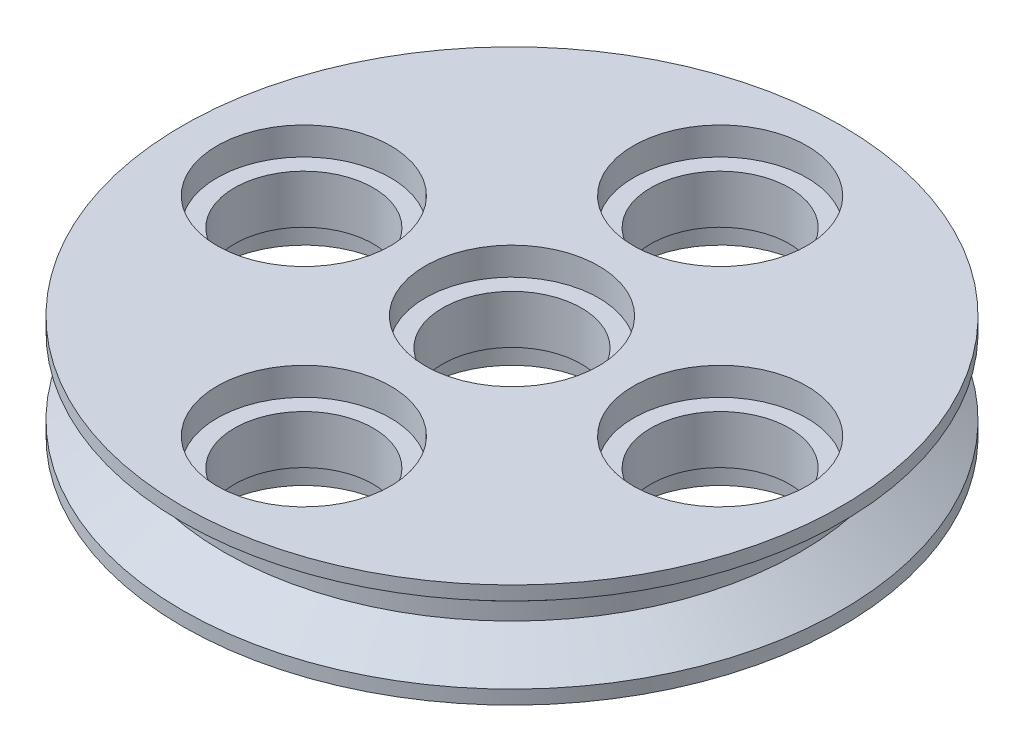
ISO-10303-21;
HEADER;
FILE_DESCRIPTION(('STEP AP214'),'2;1');
FILE_NAME('part.step','',(''),(''),'','','');
FILE_SCHEMA(('AUTOMOTIVE_DESIGN { 1 0 10303 214 1 1 1 1 }'));
ENDSEC;
DATA;
#1=APPLICATION_CONTEXT('core data for automotive mechanical design processes');
#2=APPLICATION_PROTOCOL_DEFINITION('international standard','automotive_design',2000,#1);
#3=PRODUCT_CONTEXT('',#1,'mechanical');
#4=PRODUCT('Part','Part','',(#3));
#5=PRODUCT_RELATED_PRODUCT_CATEGORY('part','',(#4));
#6=PRODUCT_DEFINITION_FORMATION('','',#4);
#7=PRODUCT_DEFINITION_CONTEXT('part definition',#1,'design');
#8=PRODUCT_DEFINITION('design','',#6,#7);
#9=PRODUCT_DEFINITION_SHAPE('','',#8);
#10=(LENGTH_UNIT() NAMED_UNIT(*) SI_UNIT(.MILLI.,.METRE.));
#11=(NAMED_UNIT(*) PLANE_ANGLE_UNIT() SI_UNIT($,.RADIAN.));
#12=(NAMED_UNIT(*) SI_UNIT($,.STERADIAN.) SOLID_ANGLE_UNIT());
#13=UNCERTAINTY_MEASURE_WITH_UNIT(LENGTH_MEASURE(1.E-05),#10,'distance_accuracy_value','');
#14=(GEOMETRIC_REPRESENTATION_CONTEXT(3) GLOBAL_UNCERTAINTY_ASSIGNED_CONTEXT((#13)) GLOBAL_UNIT_ASSIGNED_CONTEXT((#10,
#11,#12)) REPRESENTATION_CONTEXT('',''));
#15=CARTESIAN_POINT('',(0.,0.,0.));
#16=DIRECTION('',(0.,0.,1.));
#17=DIRECTION('',(1.,0.,0.));
#18=AXIS2_PLACEMENT_3D('',#15,#16,#17);
#19=CARTESIAN_POINT('',(0.,1.5,0.));
#20=DIRECTION('',(0.,-1.,0.));
#21=DIRECTION('',(0.,0.,-1.));
#22=AXIS2_PLACEMENT_3D('',#19,#20,#21);
#23=PLANE('',#22);
#24=CARTESIAN_POINT('',(0.,1.5,0.));
#25=DIRECTION('',(0.,-1.,0.));
#26=DIRECTION('',(0.,0.,-1.));
#27=AXIS2_PLACEMENT_3D('',#24,#25,#26);
#28=CIRCLE('',#27,9.5);
#29=CARTESIAN_POINT('',(0.,1.5,-9.5));
#30=VERTEX_POINT('',#29);
#31=EDGE_CURVE('E106',#30,#30,#28,.T.);
#32=ORIENTED_EDGE('',*,*,#31,.F.);
#33=EDGE_LOOP('',(#32));
#34=FACE_BOUND('',#33,.T.);
#35=CARTESIAN_POINT('',(6.,1.5,0.));
#36=DIRECTION('',(0.,1.,0.));
#37=DIRECTION('',(0.,0.,1.));
#38=AXIS2_PLACEMENT_3D('',#35,#36,#37);
#39=CIRCLE('',#38,2.5);
#40=CARTESIAN_POINT('',(6.,1.5,2.5));
#41=VERTEX_POINT('',#40);
#42=EDGE_CURVE('E109',#41,#41,#39,.F.);
#43=ORIENTED_EDGE('',*,*,#42,.T.);
#44=EDGE_LOOP('',(#43));
#45=FACE_BOUND('',#44,.T.);
#46=CARTESIAN_POINT('',(0.,1.5,6.));
#47=DIRECTION('',(0.,1.,0.));
#48=DIRECTION('',(0.,0.,1.));
#49=AXIS2_PLACEMENT_3D('',#46,#47,#48);
#50=CIRCLE('',#49,2.5);
#51=CARTESIAN_POINT('',(0.,1.5,8.5));
#52=VERTEX_POINT('',#51);
#53=EDGE_CURVE('E112',#52,#52,#50,.F.);
#54=ORIENTED_EDGE('',*,*,#53,.T.);
#55=EDGE_LOOP('',(#54));
#56=FACE_BOUND('',#55,.T.);
#57=CARTESIAN_POINT('',(-6.,1.5,0.));
#58=DIRECTION('',(0.,1.,0.));
#59=DIRECTION('',(0.,0.,1.));
#60=AXIS2_PLACEMENT_3D('',#57,#58,#59);
#61=CIRCLE('',#60,2.5);
#62=CARTESIAN_POINT('',(-6.,1.5,2.5));
#63=VERTEX_POINT('',#62);
#64=EDGE_CURVE('E115',#63,#63,#61,.F.);
#65=ORIENTED_EDGE('',*,*,#64,.T.);
#66=EDGE_LOOP('',(#65));
#67=FACE_BOUND('',#66,.T.);
#68=CARTESIAN_POINT('',(0.,1.5,-6.));
#69=DIRECTION('',(0.,1.,0.));
#70=DIRECTION('',(0.,0.,1.));
#71=AXIS2_PLACEMENT_3D('',#68,#69,#70);
#72=CIRCLE('',#71,2.5);
#73=CARTESIAN_POINT('',(0.,1.5,-3.5));
#74=VERTEX_POINT('',#73);
#75=EDGE_CURVE('E117',#74,#74,#72,.F.);
#76=ORIENTED_EDGE('',*,*,#75,.T.);
#77=EDGE_LOOP('',(#76));
#78=FACE_BOUND('',#77,.T.);
#79=CARTESIAN_POINT('',(0.,1.5,0.));
#80=DIRECTION('',(0.,1.,0.));
#81=DIRECTION('',(0.,0.,1.));
#82=AXIS2_PLACEMENT_3D('',#79,#80,#81);
#83=CIRCLE('',#82,2.5);
#84=CARTESIAN_POINT('',(0.,1.5,2.5));
#85=VERTEX_POINT('',#84);
#86=EDGE_CURVE('E17',#85,#85,#83,.F.);
#87=ORIENTED_EDGE('',*,*,#86,.T.);
#88=EDGE_LOOP('',(#87));
#89=FACE_BOUND('',#88,.T.);
#90=ADVANCED_FACE('F14',(#34,#45,#56,#67,#78,#89),#23,.F.);
#91=CARTESIAN_POINT('',(0.,1.5,0.));
#92=DIRECTION('',(0.,1.,0.));
#93=DIRECTION('',(0.,0.,1.));
#94=AXIS2_PLACEMENT_3D('',#91,#92,#93);
#95=CYLINDRICAL_SURFACE('',#94,2.5);
#96=CARTESIAN_POINT('',(0.,0.700000000000001,0.));
#97=DIRECTION('',(0.,1.,0.));
#98=DIRECTION('',(0.,0.,1.));
#99=AXIS2_PLACEMENT_3D('',#96,#97,#98);
#100=CIRCLE('',#99,2.5);
#101=CARTESIAN_POINT('',(0.,0.700000000000001,2.5));
#102=VERTEX_POINT('',#101);
#103=EDGE_CURVE('E103',#102,#102,#100,.F.);
#104=ORIENTED_EDGE('',*,*,#103,.T.);
#105=EDGE_LOOP('',(#104));
#106=FACE_BOUND('',#105,.T.);
#107=ORIENTED_EDGE('',*,*,#86,.F.);
#108=EDGE_LOOP('',(#107));
#109=FACE_BOUND('',#108,.T.);
#110=ADVANCED_FACE('F125',(#106,#109),#95,.F.);
#111=CARTESIAN_POINT('',(0.,1.5,-6.));
#112=DIRECTION('',(0.,1.,0.));
#113=DIRECTION('',(0.,0.,1.));
#114=AXIS2_PLACEMENT_3D('',#111,#112,#113);
#115=CYLINDRICAL_SURFACE('',#114,2.5);
#116=CARTESIAN_POINT('',(0.,0.700000000000001,-6.));
#117=DIRECTION('',(0.,1.,0.));
#118=DIRECTION('',(0.,0.,1.));
#119=AXIS2_PLACEMENT_3D('',#116,#117,#118);
#120=CIRCLE('',#119,2.5);
#121=CARTESIAN_POINT('',(0.,0.700000000000001,-3.5));
#122=VERTEX_POINT('',#121);
#123=EDGE_CURVE('E100',#122,#122,#120,.F.);
#124=ORIENTED_EDGE('',*,*,#123,.T.);
#125=EDGE_LOOP('',(#124));
#126=FACE_BOUND('',#125,.T.);
#127=ORIENTED_EDGE('',*,*,#75,.F.);
#128=EDGE_LOOP('',(#127));
#129=FACE_BOUND('',#128,.T.);
#130=ADVANCED_FACE('F127',(#126,#129),#115,.F.);
#131=CARTESIAN_POINT('',(-6.,1.5,0.));
#132=DIRECTION('',(0.,1.,0.));
#133=DIRECTION('',(0.,0.,1.));
#134=AXIS2_PLACEMENT_3D('',#131,#132,#133);
#135=CYLINDRICAL_SURFACE('',#134,2.5);
#136=CARTESIAN_POINT('',(-6.,0.700000000000001,0.));
#137=DIRECTION('',(0.,1.,0.));
#138=DIRECTION('',(0.,0.,1.));
#139=AXIS2_PLACEMENT_3D('',#136,#137,#138);
#140=CIRCLE('',#139,2.5);
#141=CARTESIAN_POINT('',(-6.,0.700000000000001,2.5));
#142=VERTEX_POINT('',#141);
#143=EDGE_CURVE('E97',#142,#142,#140,.F.);
#144=ORIENTED_EDGE('',*,*,#143,.T.);
#145=EDGE_LOOP('',(#144));
#146=FACE_BOUND('',#145,.T.);
#147=ORIENTED_EDGE('',*,*,#64,.F.);
#148=EDGE_LOOP('',(#147));
#149=FACE_BOUND('',#148,.T.);
#150=ADVANCED_FACE('F134',(#146,#149),#135,.F.);
#151=CARTESIAN_POINT('',(0.,1.5,6.));
#152=DIRECTION('',(0.,1.,0.));
#153=DIRECTION('',(0.,0.,1.));
#154=AXIS2_PLACEMENT_3D('',#151,#152,#153);
#155=CYLINDRICAL_SURFACE('',#154,2.5);
#156=CARTESIAN_POINT('',(0.,0.700000000000001,6.));
#157=DIRECTION('',(0.,1.,0.));
#158=DIRECTION('',(0.,0.,1.));
#159=AXIS2_PLACEMENT_3D('',#156,#157,#158);
#160=CIRCLE('',#159,2.5);
#161=CARTESIAN_POINT('',(0.,0.700000000000001,8.5));
#162=VERTEX_POINT('',#161);
#163=EDGE_CURVE('E94',#162,#162,#160,.F.);
#164=ORIENTED_EDGE('',*,*,#163,.T.);
#165=EDGE_LOOP('',(#164));
#166=FACE_BOUND('',#165,.T.);
#167=ORIENTED_EDGE('',*,*,#53,.F.);
#168=EDGE_LOOP('',(#167));
#169=FACE_BOUND('',#168,.T.);
#170=ADVANCED_FACE('F248',(#166,#169),#155,.F.);
#171=CARTESIAN_POINT('',(6.,1.5,0.));
#172=DIRECTION('',(0.,1.,0.));
#173=DIRECTION('',(0.,0.,1.));
#174=AXIS2_PLACEMENT_3D('',#171,#172,#173);
#175=CYLINDRICAL_SURFACE('',#174,2.5);
#176=CARTESIAN_POINT('',(6.,0.700000000000001,0.));
#177=DIRECTION('',(0.,1.,0.));
#178=DIRECTION('',(0.,0.,1.));
#179=AXIS2_PLACEMENT_3D('',#176,#177,#178);
#180=CIRCLE('',#179,2.5);
#181=CARTESIAN_POINT('',(6.,0.700000000000001,2.5));
#182=VERTEX_POINT('',#181);
#183=EDGE_CURVE('E91',#182,#182,#180,.F.);
#184=ORIENTED_EDGE('',*,*,#183,.T.);
#185=EDGE_LOOP('',(#184));
#186=FACE_BOUND('',#185,.T.);
#187=ORIENTED_EDGE('',*,*,#42,.F.);
#188=EDGE_LOOP('',(#187));
#189=FACE_BOUND('',#188,.T.);
#190=ADVANCED_FACE('F244',(#186,#189),#175,.F.);
#191=CARTESIAN_POINT('',(0.,0.,0.));
#192=DIRECTION('',(0.,-1.,0.));
#193=DIRECTION('',(0.,0.,-1.));
#194=AXIS2_PLACEMENT_3D('',#191,#192,#193);
#195=CYLINDRICAL_SURFACE('',#194,9.5);
#196=CARTESIAN_POINT('',(0.,1.1,0.));
#197=DIRECTION('',(0.,1.,0.));
#198=DIRECTION('',(0.,0.,1.));
#199=AXIS2_PLACEMENT_3D('',#196,#197,#198);
#200=CIRCLE('',#199,9.5);
#201=CARTESIAN_POINT('',(0.,1.1,9.5));
#202=VERTEX_POINT('',#201);
#203=EDGE_CURVE('E29',#202,#202,#200,.F.);
#204=ORIENTED_EDGE('',*,*,#203,.F.);
#205=EDGE_LOOP('',(#204));
#206=FACE_BOUND('',#205,.T.);
#207=ORIENTED_EDGE('',*,*,#31,.T.);
#208=EDGE_LOOP('',(#207));
#209=FACE_BOUND('',#208,.T.);
#210=ADVANCED_FACE('F240',(#206,#209),#195,.T.);
#211=CARTESIAN_POINT('',(2.00000000000001,0.700000000000003,0.));
#212=DIRECTION('',(0.,-1.,0.));
#213=DIRECTION('',(0.,0.,-1.));
#214=AXIS2_PLACEMENT_3D('',#211,#212,#213);
#215=PLANE('',#214);
#216=ORIENTED_EDGE('',*,*,#103,.F.);
#217=EDGE_LOOP('',(#216));
#218=FACE_BOUND('',#217,.T.);
#219=CARTESIAN_POINT('',(0.,0.700000000000004,0.));
#220=DIRECTION('',(0.,1.,0.));
#221=DIRECTION('',(0.,0.,1.));
#222=AXIS2_PLACEMENT_3D('',#219,#220,#221);
#223=CIRCLE('',#222,2.00000000000001);
#224=CARTESIAN_POINT('',(0.,0.700000000000004,2.00000000000001));
#225=VERTEX_POINT('',#224);
#226=EDGE_CURVE('E88',#225,#225,#223,.F.);
#227=ORIENTED_EDGE('',*,*,#226,.T.);
#228=EDGE_LOOP('',(#227));
#229=FACE_BOUND('',#228,.T.);
#230=ADVANCED_FACE('F236',(#218,#229),#215,.F.);
#231=CARTESIAN_POINT('',(2.00000000000001,0.700000000000003,-6.));
#232=DIRECTION('',(0.,-1.,0.));
#233=DIRECTION('',(0.,0.,-1.));
#234=AXIS2_PLACEMENT_3D('',#231,#232,#233);
#235=PLANE('',#234);
#236=ORIENTED_EDGE('',*,*,#123,.F.);
#237=EDGE_LOOP('',(#236));
#238=FACE_BOUND('',#237,.T.);
#239=CARTESIAN_POINT('',(0.,0.700000000000004,-6.));
#240=DIRECTION('',(0.,1.,0.));
#241=DIRECTION('',(0.,0.,1.));
#242=AXIS2_PLACEMENT_3D('',#239,#240,#241);
#243=CIRCLE('',#242,2.00000000000001);
#244=CARTESIAN_POINT('',(0.,0.700000000000004,-3.99999999999999));
#245=VERTEX_POINT('',#244);
#246=EDGE_CURVE('E85',#245,#245,#243,.F.);
#247=ORIENTED_EDGE('',*,*,#246,.T.);
#248=EDGE_LOOP('',(#247));
#249=FACE_BOUND('',#248,.T.);
#250=ADVANCED_FACE('F232',(#238,#249),#235,.F.);
#251=CARTESIAN_POINT('',(-3.99999999999999,0.700000000000003,0.));
#252=DIRECTION('',(0.,-1.,0.));
#253=DIRECTION('',(0.,0.,-1.));
#254=AXIS2_PLACEMENT_3D('',#251,#252,#253);
#255=PLANE('',#254);
#256=ORIENTED_EDGE('',*,*,#143,.F.);
#257=EDGE_LOOP('',(#256));
#258=FACE_BOUND('',#257,.T.);
#259=CARTESIAN_POINT('',(-6.,0.700000000000004,0.));
#260=DIRECTION('',(0.,1.,0.));
#261=DIRECTION('',(0.,0.,1.));
#262=AXIS2_PLACEMENT_3D('',#259,#260,#261);
#263=CIRCLE('',#262,2.00000000000001);
#264=CARTESIAN_POINT('',(-6.,0.700000000000004,2.00000000000001));
#265=VERTEX_POINT('',#264);
#266=EDGE_CURVE('E82',#265,#265,#263,.F.);
#267=ORIENTED_EDGE('',*,*,#266,.T.);
#268=EDGE_LOOP('',(#267));
#269=FACE_BOUND('',#268,.T.);
#270=ADVANCED_FACE('F228',(#258,#269),#255,.F.);
#271=CARTESIAN_POINT('',(2.00000000000001,0.700000000000003,6.));
#272=DIRECTION('',(0.,-1.,0.));
#273=DIRECTION('',(0.,0.,-1.));
#274=AXIS2_PLACEMENT_3D('',#271,#272,#273);
#275=PLANE('',#274);
#276=ORIENTED_EDGE('',*,*,#163,.F.);
#277=EDGE_LOOP('',(#276));
#278=FACE_BOUND('',#277,.T.);
#279=CARTESIAN_POINT('',(0.,0.700000000000004,6.));
#280=DIRECTION('',(0.,1.,0.));
#281=DIRECTION('',(0.,0.,1.));
#282=AXIS2_PLACEMENT_3D('',#279,#280,#281);
#283=CIRCLE('',#282,2.00000000000001);
#284=CARTESIAN_POINT('',(0.,0.700000000000004,8.00000000000001));
#285=VERTEX_POINT('',#284);
#286=EDGE_CURVE('E79',#285,#285,#283,.F.);
#287=ORIENTED_EDGE('',*,*,#286,.T.);
#288=EDGE_LOOP('',(#287));
#289=FACE_BOUND('',#288,.T.);
#290=ADVANCED_FACE('F224',(#278,#289),#275,.F.);
#291=CARTESIAN_POINT('',(8.00000000000001,0.700000000000003,0.));
#292=DIRECTION('',(0.,-1.,0.));
#293=DIRECTION('',(0.,0.,-1.));
#294=AXIS2_PLACEMENT_3D('',#291,#292,#293);
#295=PLANE('',#294);
#296=ORIENTED_EDGE('',*,*,#183,.F.);
#297=EDGE_LOOP('',(#296));
#298=FACE_BOUND('',#297,.T.);
#299=CARTESIAN_POINT('',(6.,0.700000000000004,0.));
#300=DIRECTION('',(0.,1.,0.));
#301=DIRECTION('',(0.,0.,1.));
#302=AXIS2_PLACEMENT_3D('',#299,#300,#301);
#303=CIRCLE('',#302,2.00000000000001);
#304=CARTESIAN_POINT('',(6.,0.700000000000004,2.00000000000001));
#305=VERTEX_POINT('',#304);
#306=EDGE_CURVE('E76',#305,#305,#303,.F.);
#307=ORIENTED_EDGE('',*,*,#306,.T.);
#308=EDGE_LOOP('',(#307));
#309=FACE_BOUND('',#308,.T.);
#310=ADVANCED_FACE('F220',(#298,#309),#295,.F.);
#311=CARTESIAN_POINT('',(0.,1.1,0.));
#312=DIRECTION('',(0.,1.,0.));
#313=DIRECTION('',(0.,0.,1.));
#314=AXIS2_PLACEMENT_3D('',#311,#312,#313);
#315=CONICAL_SURFACE('',#314,9.5,0.95423717715527);
#316=ORIENTED_EDGE('',*,*,#203,.T.);
#317=EDGE_LOOP('',(#316));
#318=FACE_BOUND('',#317,.T.);
#319=CARTESIAN_POINT('',(0.,0.25,0.));
#320=DIRECTION('',(0.,-1.,0.));
#321=DIRECTION('',(0.,0.,-1.));
#322=AXIS2_PLACEMENT_3D('',#319,#320,#321);
#323=CIRCLE('',#322,8.3006668519548);
#324=CARTESIAN_POINT('',(0.,0.25,-8.3006668519548));
#325=VERTEX_POINT('',#324);
#326=EDGE_CURVE('E75',#325,#325,#323,.T.);
#327=ORIENTED_EDGE('',*,*,#326,.F.);
#328=EDGE_LOOP('',(#327));
#329=FACE_BOUND('',#328,.T.);
#330=ADVANCED_FACE('F216',(#318,#329),#315,.T.);
#331=CARTESIAN_POINT('',(0.,1.5,0.));
#332=DIRECTION('',(0.,1.,0.));
#333=DIRECTION('',(0.,0.,1.));
#334=AXIS2_PLACEMENT_3D('',#331,#332,#333);
#335=CYLINDRICAL_SURFACE('',#334,2.00000000000001);
#336=CARTESIAN_POINT('',(0.,-0.700000000000004,0.));
#337=DIRECTION('',(0.,1.,0.));
#338=DIRECTION('',(0.,0.,1.));
#339=AXIS2_PLACEMENT_3D('',#336,#337,#338);
#340=CIRCLE('',#339,2.00000000000001);
#341=CARTESIAN_POINT('',(0.,-0.700000000000004,2.00000000000001));
#342=VERTEX_POINT('',#341);
#343=EDGE_CURVE('E72',#342,#342,#340,.F.);
#344=ORIENTED_EDGE('',*,*,#343,.T.);
#345=EDGE_LOOP('',(#344));
#346=FACE_BOUND('',#345,.T.);
#347=ORIENTED_EDGE('',*,*,#226,.F.);
#348=EDGE_LOOP('',(#347));
#349=FACE_BOUND('',#348,.T.);
#350=ADVANCED_FACE('F212',(#346,#349),#335,.F.);
#351=CARTESIAN_POINT('',(0.,1.5,-6.));
#352=DIRECTION('',(0.,1.,0.));
#353=DIRECTION('',(0.,0.,1.));
#354=AXIS2_PLACEMENT_3D('',#351,#352,#353);
#355=CYLINDRICAL_SURFACE('',#354,2.00000000000001);
#356=CARTESIAN_POINT('',(0.,-0.700000000000004,-6.));
#357=DIRECTION('',(0.,1.,0.));
#358=DIRECTION('',(0.,0.,1.));
#359=AXIS2_PLACEMENT_3D('',#356,#357,#358);
#360=CIRCLE('',#359,2.00000000000001);
#361=CARTESIAN_POINT('',(0.,-0.700000000000004,-3.99999999999999));
#362=VERTEX_POINT('',#361);
#363=EDGE_CURVE('E69',#362,#362,#360,.F.);
#364=ORIENTED_EDGE('',*,*,#363,.T.);
#365=EDGE_LOOP('',(#364));
#366=FACE_BOUND('',#365,.T.);
#367=ORIENTED_EDGE('',*,*,#246,.F.);
#368=EDGE_LOOP('',(#367));
#369=FACE_BOUND('',#368,.T.);
#370=ADVANCED_FACE('F208',(#366,#369),#355,.F.);
#371=CARTESIAN_POINT('',(-6.,1.5,0.));
#372=DIRECTION('',(0.,1.,0.));
#373=DIRECTION('',(0.,0.,1.));
#374=AXIS2_PLACEMENT_3D('',#371,#372,#373);
#375=CYLINDRICAL_SURFACE('',#374,2.00000000000001);
#376=CARTESIAN_POINT('',(-6.,-0.700000000000004,0.));
#377=DIRECTION('',(0.,1.,0.));
#378=DIRECTION('',(0.,0.,1.));
#379=AXIS2_PLACEMENT_3D('',#376,#377,#378);
#380=CIRCLE('',#379,2.00000000000001);
#381=CARTESIAN_POINT('',(-6.,-0.700000000000004,2.00000000000001));
#382=VERTEX_POINT('',#381);
#383=EDGE_CURVE('E66',#382,#382,#380,.F.);
#384=ORIENTED_EDGE('',*,*,#383,.T.);
#385=EDGE_LOOP('',(#384));
#386=FACE_BOUND('',#385,.T.);
#387=ORIENTED_EDGE('',*,*,#266,.F.);
#388=EDGE_LOOP('',(#387));
#389=FACE_BOUND('',#388,.T.);
#390=ADVANCED_FACE('F204',(#386,#389),#375,.F.);
#391=CARTESIAN_POINT('',(0.,1.5,6.));
#392=DIRECTION('',(0.,1.,0.));
#393=DIRECTION('',(0.,0.,1.));
#394=AXIS2_PLACEMENT_3D('',#391,#392,#393);
#395=CYLINDRICAL_SURFACE('',#394,2.00000000000001);
#396=CARTESIAN_POINT('',(0.,-0.700000000000004,6.));
#397=DIRECTION('',(0.,1.,0.));
#398=DIRECTION('',(0.,0.,1.));
#399=AXIS2_PLACEMENT_3D('',#396,#397,#398);
#400=CIRCLE('',#399,2.00000000000001);
#401=CARTESIAN_POINT('',(0.,-0.700000000000004,8.00000000000001));
#402=VERTEX_POINT('',#401);
#403=EDGE_CURVE('E63',#402,#402,#400,.F.);
#404=ORIENTED_EDGE('',*,*,#403,.T.);
#405=EDGE_LOOP('',(#404));
#406=FACE_BOUND('',#405,.T.);
#407=ORIENTED_EDGE('',*,*,#286,.F.);
#408=EDGE_LOOP('',(#407));
#409=FACE_BOUND('',#408,.T.);
#410=ADVANCED_FACE('F200',(#406,#409),#395,.F.);
#411=CARTESIAN_POINT('',(6.,1.5,0.));
#412=DIRECTION('',(0.,1.,0.));
#413=DIRECTION('',(0.,0.,1.));
#414=AXIS2_PLACEMENT_3D('',#411,#412,#413);
#415=CYLINDRICAL_SURFACE('',#414,2.00000000000001);
#416=CARTESIAN_POINT('',(6.,-0.700000000000004,0.));
#417=DIRECTION('',(0.,1.,0.));
#418=DIRECTION('',(0.,0.,1.));
#419=AXIS2_PLACEMENT_3D('',#416,#417,#418);
#420=CIRCLE('',#419,2.00000000000001);
#421=CARTESIAN_POINT('',(6.,-0.700000000000004,2.00000000000001));
#422=VERTEX_POINT('',#421);
#423=EDGE_CURVE('E60',#422,#422,#420,.F.);
#424=ORIENTED_EDGE('',*,*,#423,.T.);
#425=EDGE_LOOP('',(#424));
#426=FACE_BOUND('',#425,.T.);
#427=ORIENTED_EDGE('',*,*,#306,.F.);
#428=EDGE_LOOP('',(#427));
#429=FACE_BOUND('',#428,.T.);
#430=ADVANCED_FACE('F196',(#426,#429),#415,.F.);
#431=CARTESIAN_POINT('',(0.,0.,0.));
#432=DIRECTION('',(0.,-1.,0.));
#433=DIRECTION('',(0.,0.,-1.));
#434=AXIS2_PLACEMENT_3D('',#431,#432,#433);
#435=CYLINDRICAL_SURFACE('',#434,8.3006668519548);
#436=CARTESIAN_POINT('',(0.,-0.25,0.));
#437=DIRECTION('',(0.,-1.,0.));
#438=DIRECTION('',(0.,0.,1.));
#439=AXIS2_PLACEMENT_3D('',#436,#437,#438);
#440=CIRCLE('',#439,8.3006668519548);
#441=CARTESIAN_POINT('',(0.,-0.25,8.3006668519548));
#442=VERTEX_POINT('',#441);
#443=EDGE_CURVE('E59',#442,#442,#440,.T.);
#444=ORIENTED_EDGE('',*,*,#443,.F.);
#445=EDGE_LOOP('',(#444));
#446=FACE_BOUND('',#445,.T.);
#447=ORIENTED_EDGE('',*,*,#326,.T.);
#448=EDGE_LOOP('',(#447));
#449=FACE_BOUND('',#448,.T.);
#450=ADVANCED_FACE('F192',(#446,#449),#435,.T.);
#451=CARTESIAN_POINT('',(2.00000000000001,-0.700000000000003,0.));
#452=DIRECTION('',(0.,1.,0.));
#453=DIRECTION('',(0.,0.,1.));
#454=AXIS2_PLACEMENT_3D('',#451,#452,#453);
#455=PLANE('',#454);
#456=CARTESIAN_POINT('',(0.,-0.700000000000001,0.));
#457=DIRECTION('',(0.,-1.,0.));
#458=DIRECTION('',(0.,0.,-1.));
#459=AXIS2_PLACEMENT_3D('',#456,#457,#458);
#460=CIRCLE('',#459,2.5);
#461=CARTESIAN_POINT('',(0.,-0.700000000000001,-2.5));
#462=VERTEX_POINT('',#461);
#463=EDGE_CURVE('E56',#462,#462,#460,.T.);
#464=ORIENTED_EDGE('',*,*,#463,.T.);
#465=EDGE_LOOP('',(#464));
#466=FACE_BOUND('',#465,.T.);
#467=ORIENTED_EDGE('',*,*,#343,.F.);
#468=EDGE_LOOP('',(#467));
#469=FACE_BOUND('',#468,.T.);
#470=ADVANCED_FACE('F188',(#466,#469),#455,.F.);
#471=CARTESIAN_POINT('',(2.00000000000001,-0.700000000000003,-6.));
#472=DIRECTION('',(0.,1.,0.));
#473=DIRECTION('',(0.,0.,1.));
#474=AXIS2_PLACEMENT_3D('',#471,#472,#473);
#475=PLANE('',#474);
#476=CARTESIAN_POINT('',(0.,-0.700000000000001,-6.));
#477=DIRECTION('',(0.,-1.,0.));
#478=DIRECTION('',(0.,0.,-1.));
#479=AXIS2_PLACEMENT_3D('',#476,#477,#478);
#480=CIRCLE('',#479,2.5);
#481=CARTESIAN_POINT('',(0.,-0.700000000000001,-8.5));
#482=VERTEX_POINT('',#481);
#483=EDGE_CURVE('E53',#482,#482,#480,.T.);
#484=ORIENTED_EDGE('',*,*,#483,.T.);
#485=EDGE_LOOP('',(#484));
#486=FACE_BOUND('',#485,.T.);
#487=ORIENTED_EDGE('',*,*,#363,.F.);
#488=EDGE_LOOP('',(#487));
#489=FACE_BOUND('',#488,.T.);
#490=ADVANCED_FACE('F184',(#486,#489),#475,.F.);
#491=CARTESIAN_POINT('',(-3.99999999999999,-0.700000000000003,0.));
#492=DIRECTION('',(0.,1.,0.));
#493=DIRECTION('',(0.,0.,1.));
#494=AXIS2_PLACEMENT_3D('',#491,#492,#493);
#495=PLANE('',#494);
#496=CARTESIAN_POINT('',(-6.,-0.700000000000001,0.));
#497=DIRECTION('',(0.,-1.,0.));
#498=DIRECTION('',(0.,0.,-1.));
#499=AXIS2_PLACEMENT_3D('',#496,#497,#498);
#500=CIRCLE('',#499,2.5);
#501=CARTESIAN_POINT('',(-6.,-0.700000000000001,-2.5));
#502=VERTEX_POINT('',#501);
#503=EDGE_CURVE('E50',#502,#502,#500,.T.);
#504=ORIENTED_EDGE('',*,*,#503,.T.);
#505=EDGE_LOOP('',(#504));
#506=FACE_BOUND('',#505,.T.);
#507=ORIENTED_EDGE('',*,*,#383,.F.);
#508=EDGE_LOOP('',(#507));
#509=FACE_BOUND('',#508,.T.);
#510=ADVANCED_FACE('F180',(#506,#509),#495,.F.);
#511=CARTESIAN_POINT('',(2.00000000000001,-0.700000000000003,6.));
#512=DIRECTION('',(0.,1.,0.));
#513=DIRECTION('',(0.,0.,1.));
#514=AXIS2_PLACEMENT_3D('',#511,#512,#513);
#515=PLANE('',#514);
#516=CARTESIAN_POINT('',(0.,-0.700000000000001,6.));
#517=DIRECTION('',(0.,-1.,0.));
#518=DIRECTION('',(0.,0.,-1.));
#519=AXIS2_PLACEMENT_3D('',#516,#517,#518);
#520=CIRCLE('',#519,2.5);
#521=CARTESIAN_POINT('',(0.,-0.700000000000001,3.5));
#522=VERTEX_POINT('',#521);
#523=EDGE_CURVE('E47',#522,#522,#520,.T.);
#524=ORIENTED_EDGE('',*,*,#523,.T.);
#525=EDGE_LOOP('',(#524));
#526=FACE_BOUND('',#525,.T.);
#527=ORIENTED_EDGE('',*,*,#403,.F.);
#528=EDGE_LOOP('',(#527));
#529=FACE_BOUND('',#528,.T.);
#530=ADVANCED_FACE('F176',(#526,#529),#515,.F.);
#531=CARTESIAN_POINT('',(8.00000000000001,-0.700000000000003,0.));
#532=DIRECTION('',(0.,1.,0.));
#533=DIRECTION('',(0.,0.,1.));
#534=AXIS2_PLACEMENT_3D('',#531,#532,#533);
#535=PLANE('',#534);
#536=CARTESIAN_POINT('',(6.,-0.700000000000001,0.));
#537=DIRECTION('',(0.,-1.,0.));
#538=DIRECTION('',(0.,0.,-1.));
#539=AXIS2_PLACEMENT_3D('',#536,#537,#538);
#540=CIRCLE('',#539,2.5);
#541=CARTESIAN_POINT('',(6.,-0.700000000000001,-2.5));
#542=VERTEX_POINT('',#541);
#543=EDGE_CURVE('E44',#542,#542,#540,.T.);
#544=ORIENTED_EDGE('',*,*,#543,.T.);
#545=EDGE_LOOP('',(#544));
#546=FACE_BOUND('',#545,.T.);
#547=ORIENTED_EDGE('',*,*,#423,.F.);
#548=EDGE_LOOP('',(#547));
#549=FACE_BOUND('',#548,.T.);
#550=ADVANCED_FACE('F172',(#546,#549),#535,.F.);
#551=CARTESIAN_POINT('',(0.,-1.1,0.));
#552=DIRECTION('',(0.,-1.,0.));
#553=DIRECTION('',(0.,0.,-1.));
#554=AXIS2_PLACEMENT_3D('',#551,#552,#553);
#555=CONICAL_SURFACE('',#554,9.5,0.95423717715527);
#556=ORIENTED_EDGE('',*,*,#443,.T.);
#557=EDGE_LOOP('',(#556));
#558=FACE_BOUND('',#557,.T.);
#559=CARTESIAN_POINT('',(0.,-1.1,0.));
#560=DIRECTION('',(0.,1.,0.));
#561=DIRECTION('',(0.,0.,1.));
#562=AXIS2_PLACEMENT_3D('',#559,#560,#561);
#563=CIRCLE('',#562,9.5);
#564=CARTESIAN_POINT('',(0.,-1.1,9.5));
#565=VERTEX_POINT('',#564);
#566=EDGE_CURVE('E43',#565,#565,#563,.F.);
#567=ORIENTED_EDGE('',*,*,#566,.F.);
#568=EDGE_LOOP('',(#567));
#569=FACE_BOUND('',#568,.T.);
#570=ADVANCED_FACE('F168',(#558,#569),#555,.T.);
#571=CARTESIAN_POINT('',(0.,-1.5,0.));
#572=DIRECTION('',(0.,-1.,0.));
#573=DIRECTION('',(0.,0.,-1.));
#574=AXIS2_PLACEMENT_3D('',#571,#572,#573);
#575=CYLINDRICAL_SURFACE('',#574,2.5);
#576=CARTESIAN_POINT('',(0.,-1.5,0.));
#577=DIRECTION('',(0.,-1.,0.));
#578=DIRECTION('',(0.,0.,-1.));
#579=AXIS2_PLACEMENT_3D('',#576,#577,#578);
#580=CIRCLE('',#579,2.5);
#581=CARTESIAN_POINT('',(0.,-1.5,-2.5));
#582=VERTEX_POINT('',#581);
#583=EDGE_CURVE('E40',#582,#582,#580,.T.);
#584=ORIENTED_EDGE('',*,*,#583,.T.);
#585=EDGE_LOOP('',(#584));
#586=FACE_BOUND('',#585,.T.);
#587=ORIENTED_EDGE('',*,*,#463,.F.);
#588=EDGE_LOOP('',(#587));
#589=FACE_BOUND('',#588,.T.);
#590=ADVANCED_FACE('F164',(#586,#589),#575,.F.);
#591=CARTESIAN_POINT('',(0.,-1.5,-6.));
#592=DIRECTION('',(0.,-1.,0.));
#593=DIRECTION('',(0.,0.,-1.));
#594=AXIS2_PLACEMENT_3D('',#591,#592,#593);
#595=CYLINDRICAL_SURFACE('',#594,2.5);
#596=CARTESIAN_POINT('',(0.,-1.5,-6.));
#597=DIRECTION('',(0.,-1.,0.));
#598=DIRECTION('',(0.,0.,-1.));
#599=AXIS2_PLACEMENT_3D('',#596,#597,#598);
#600=CIRCLE('',#599,2.5);
#601=CARTESIAN_POINT('',(0.,-1.5,-8.5));
#602=VERTEX_POINT('',#601);
#603=EDGE_CURVE('E37',#602,#602,#600,.T.);
#604=ORIENTED_EDGE('',*,*,#603,.T.);
#605=EDGE_LOOP('',(#604));
#606=FACE_BOUND('',#605,.T.);
#607=ORIENTED_EDGE('',*,*,#483,.F.);
#608=EDGE_LOOP('',(#607));
#609=FACE_BOUND('',#608,.T.);
#610=ADVANCED_FACE('F160',(#606,#609),#595,.F.);
#611=CARTESIAN_POINT('',(-6.,-1.5,0.));
#612=DIRECTION('',(0.,-1.,0.));
#613=DIRECTION('',(0.,0.,-1.));
#614=AXIS2_PLACEMENT_3D('',#611,#612,#613);
#615=CYLINDRICAL_SURFACE('',#614,2.5);
#616=CARTESIAN_POINT('',(-6.,-1.5,0.));
#617=DIRECTION('',(0.,-1.,0.));
#618=DIRECTION('',(0.,0.,-1.));
#619=AXIS2_PLACEMENT_3D('',#616,#617,#618);
#620=CIRCLE('',#619,2.5);
#621=CARTESIAN_POINT('',(-6.,-1.5,-2.5));
#622=VERTEX_POINT('',#621);
#623=EDGE_CURVE('E34',#622,#622,#620,.T.);
#624=ORIENTED_EDGE('',*,*,#623,.T.);
#625=EDGE_LOOP('',(#624));
#626=FACE_BOUND('',#625,.T.);
#627=ORIENTED_EDGE('',*,*,#503,.F.);
#628=EDGE_LOOP('',(#627));
#629=FACE_BOUND('',#628,.T.);
#630=ADVANCED_FACE('F156',(#626,#629),#615,.F.);
#631=CARTESIAN_POINT('',(0.,-1.5,6.));
#632=DIRECTION('',(0.,-1.,0.));
#633=DIRECTION('',(0.,0.,-1.));
#634=AXIS2_PLACEMENT_3D('',#631,#632,#633);
#635=CYLINDRICAL_SURFACE('',#634,2.5);
#636=CARTESIAN_POINT('',(0.,-1.5,6.));
#637=DIRECTION('',(0.,-1.,0.));
#638=DIRECTION('',(0.,0.,-1.));
#639=AXIS2_PLACEMENT_3D('',#636,#637,#638);
#640=CIRCLE('',#639,2.5);
#641=CARTESIAN_POINT('',(0.,-1.5,3.5));
#642=VERTEX_POINT('',#641);
#643=EDGE_CURVE('E26',#642,#642,#640,.T.);
#644=ORIENTED_EDGE('',*,*,#643,.T.);
#645=EDGE_LOOP('',(#644));
#646=FACE_BOUND('',#645,.T.);
#647=ORIENTED_EDGE('',*,*,#523,.F.);
#648=EDGE_LOOP('',(#647));
#649=FACE_BOUND('',#648,.T.);
#650=ADVANCED_FACE('F152',(#646,#649),#635,.F.);
#651=CARTESIAN_POINT('',(6.,-1.5,0.));
#652=DIRECTION('',(0.,-1.,0.));
#653=DIRECTION('',(0.,0.,-1.));
#654=AXIS2_PLACEMENT_3D('',#651,#652,#653);
#655=CYLINDRICAL_SURFACE('',#654,2.5);
#656=CARTESIAN_POINT('',(6.,-1.5,0.));
#657=DIRECTION('',(0.,-1.,0.));
#658=DIRECTION('',(0.,0.,-1.));
#659=AXIS2_PLACEMENT_3D('',#656,#657,#658);
#660=CIRCLE('',#659,2.5);
#661=CARTESIAN_POINT('',(6.,-1.5,-2.5));
#662=VERTEX_POINT('',#661);
#663=EDGE_CURVE('E21',#662,#662,#660,.T.);
#664=ORIENTED_EDGE('',*,*,#663,.T.);
#665=EDGE_LOOP('',(#664));
#666=FACE_BOUND('',#665,.T.);
#667=ORIENTED_EDGE('',*,*,#543,.F.);
#668=EDGE_LOOP('',(#667));
#669=FACE_BOUND('',#668,.T.);
#670=ADVANCED_FACE('F146',(#666,#669),#655,.F.);
#671=CARTESIAN_POINT('',(0.,0.,0.));
#672=DIRECTION('',(0.,1.,0.));
#673=DIRECTION('',(0.,0.,1.));
#674=AXIS2_PLACEMENT_3D('',#671,#672,#673);
#675=CYLINDRICAL_SURFACE('',#674,9.5);
#676=CARTESIAN_POINT('',(0.,-1.5,0.));
#677=DIRECTION('',(0.,1.,0.));
#678=DIRECTION('',(0.,0.,1.));
#679=AXIS2_PLACEMENT_3D('',#676,#677,#678);
#680=CIRCLE('',#679,9.5);
#681=CARTESIAN_POINT('',(0.,-1.5,9.5));
#682=VERTEX_POINT('',#681);
#683=EDGE_CURVE('E10',#682,#682,#680,.T.);
#684=ORIENTED_EDGE('',*,*,#683,.T.);
#685=EDGE_LOOP('',(#684));
#686=FACE_BOUND('',#685,.T.);
#687=ORIENTED_EDGE('',*,*,#566,.T.);
#688=EDGE_LOOP('',(#687));
#689=FACE_BOUND('',#688,.T.);
#690=ADVANCED_FACE('F140',(#686,#689),#675,.T.);
#691=CARTESIAN_POINT('',(0.,-1.5,0.));
#692=DIRECTION('',(0.,1.,0.));
#693=DIRECTION('',(0.,0.,1.));
#694=AXIS2_PLACEMENT_3D('',#691,#692,#693);
#695=PLANE('',#694);
#696=ORIENTED_EDGE('',*,*,#683,.F.);
#697=EDGE_LOOP('',(#696));
#698=FACE_BOUND('',#697,.T.);
#699=ORIENTED_EDGE('',*,*,#663,.F.);
#700=EDGE_LOOP('',(#699));
#701=FACE_BOUND('',#700,.T.);
#702=ORIENTED_EDGE('',*,*,#643,.F.);
#703=EDGE_LOOP('',(#702));
#704=FACE_BOUND('',#703,.T.);
#705=ORIENTED_EDGE('',*,*,#623,.F.);
#706=EDGE_LOOP('',(#705));
#707=FACE_BOUND('',#706,.T.);
#708=ORIENTED_EDGE('',*,*,#603,.F.);
#709=EDGE_LOOP('',(#708));
#710=FACE_BOUND('',#709,.T.);
#711=ORIENTED_EDGE('',*,*,#583,.F.);
#712=EDGE_LOOP('',(#711));
#713=FACE_BOUND('',#712,.T.);
#714=ADVANCED_FACE('F138',(#698,#701,#704,#707,#710,#713),#695,.F.);
#715=CLOSED_SHELL('',(#90,#110,#130,#150,#170,#190,#210,#230,#250,#270,#290,#310,#330,#350,#370,
#390,#410,#430,#450,#470,#490,#510,#530,#550,#570,#590,#610,#630,#650,#670,#690,#714));
#716=MANIFOLD_SOLID_BREP('B1',#715);
#717=ADVANCED_BREP_SHAPE_REPRESENTATION('',(#18,#716),#14);
#718=SHAPE_DEFINITION_REPRESENTATION(#9,#717);
ENDSEC;
END-ISO-10303-21;
